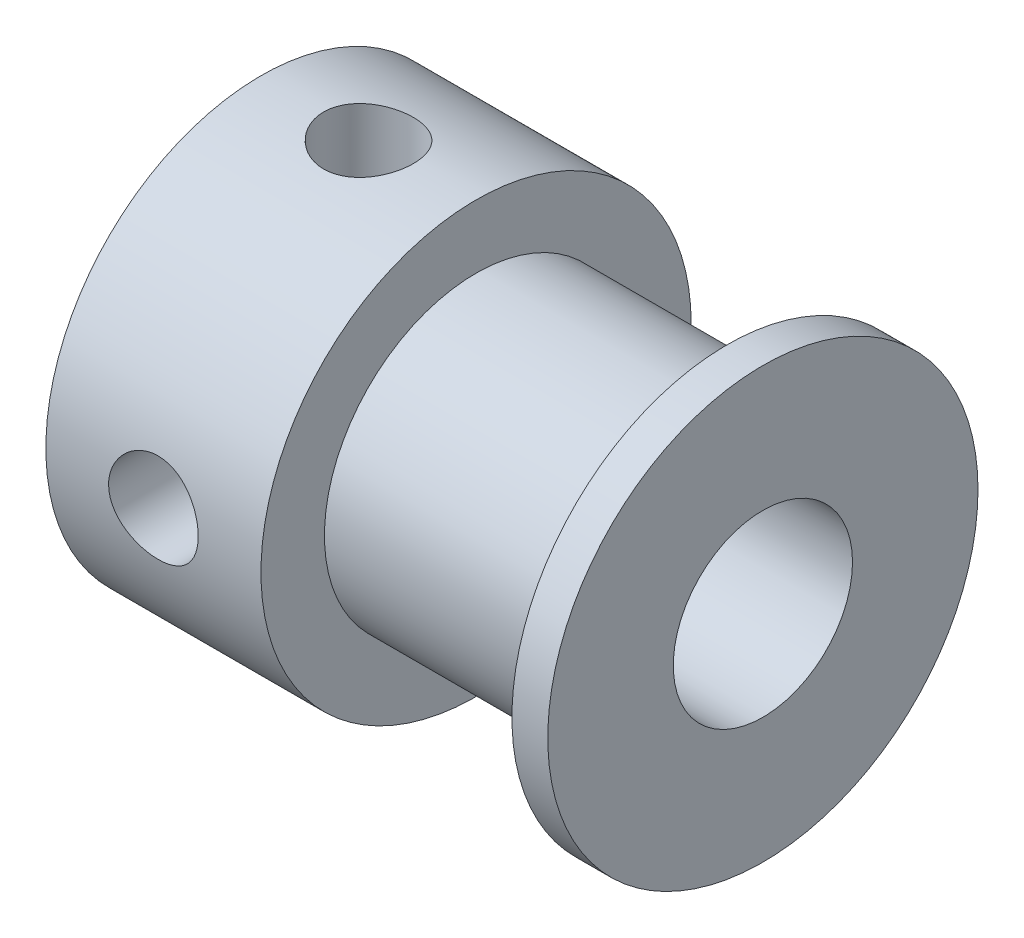
ISO-10303-21;
HEADER;
FILE_DESCRIPTION(('STEP AP214'),'2;1');
FILE_NAME('part.step','',(''),(''),'','','');
FILE_SCHEMA(('AUTOMOTIVE_DESIGN { 1 0 10303 214 1 1 1 1 }'));
ENDSEC;
DATA;
#1=APPLICATION_CONTEXT('core data for automotive mechanical design processes');
#2=APPLICATION_PROTOCOL_DEFINITION('international standard','automotive_design',2000,#1);
#3=PRODUCT_CONTEXT('',#1,'mechanical');
#4=PRODUCT('Part','Part','',(#3));
#5=PRODUCT_RELATED_PRODUCT_CATEGORY('part','',(#4));
#6=PRODUCT_DEFINITION_FORMATION('','',#4);
#7=PRODUCT_DEFINITION_CONTEXT('part definition',#1,'design');
#8=PRODUCT_DEFINITION('design','',#6,#7);
#9=PRODUCT_DEFINITION_SHAPE('','',#8);
#10=(LENGTH_UNIT() NAMED_UNIT(*) SI_UNIT(.MILLI.,.METRE.));
#11=(NAMED_UNIT(*) PLANE_ANGLE_UNIT() SI_UNIT($,.RADIAN.));
#12=(NAMED_UNIT(*) SI_UNIT($,.STERADIAN.) SOLID_ANGLE_UNIT());
#13=UNCERTAINTY_MEASURE_WITH_UNIT(LENGTH_MEASURE(1.E-05),#10,'distance_accuracy_value','');
#14=(GEOMETRIC_REPRESENTATION_CONTEXT(3) GLOBAL_UNCERTAINTY_ASSIGNED_CONTEXT((#13)) GLOBAL_UNIT_ASSIGNED_CONTEXT((#10,
#11,#12)) REPRESENTATION_CONTEXT('',''));
#15=CARTESIAN_POINT('',(0.,0.,0.));
#16=DIRECTION('',(0.,0.,1.));
#17=DIRECTION('',(1.,0.,0.));
#18=AXIS2_PLACEMENT_3D('',#15,#16,#17);
#19=CARTESIAN_POINT('',(0.,0.,0.));
#20=DIRECTION('',(1.,0.,0.));
#21=DIRECTION('',(0.,0.,-1.));
#22=AXIS2_PLACEMENT_3D('',#19,#20,#21);
#23=CYLINDRICAL_SURFACE('',#22,2.5);
#24=CARTESIAN_POINT('',(1.75000000000001,0.,2.5));
#25=CARTESIAN_POINT('',(1.75000412789938,0.0657149536912327,2.49999641755189));
#26=CARTESIAN_POINT('',(1.7552125914021,0.13150824962254,2.49738113774397));
#27=CARTESIAN_POINT('',(1.77581610042615,0.26115029408553,2.48717695046745));
#28=CARTESIAN_POINT('',(1.79123049124707,0.324995108391878,2.4795785978623));
#29=CARTESIAN_POINT('',(1.831492260771,0.448666931100716,2.4602034925414));
#30=CARTESIAN_POINT('',(1.85630298031002,0.508508503673972,2.448442989719));
#31=CARTESIAN_POINT('',(1.91446327670618,0.623090771008203,2.42182220644723));
#32=CARTESIAN_POINT('',(1.94781218031107,0.677831867487559,2.40696217041913));
#33=CARTESIAN_POINT('',(2.02439656185663,0.784384772202394,2.37445322822571));
#34=CARTESIAN_POINT('',(2.06810809904956,0.835819013902635,2.3566899890942));
#35=CARTESIAN_POINT('',(2.1631518490588,0.930974306083716,2.32074962808431));
#36=CARTESIAN_POINT('',(2.21448981471555,0.974689478883452,2.30257220261294));
#37=CARTESIAN_POINT('',(2.32810418690423,1.05656500056284,2.26623688996684));
#38=CARTESIAN_POINT('',(2.39092012293239,1.09403166943954,2.24818983712665));
#39=CARTESIAN_POINT('',(2.52295916998277,1.15771028361336,2.21607473465401));
#40=CARTESIAN_POINT('',(2.59217766090344,1.18393026870791,2.20200384508737));
#41=CARTESIAN_POINT('',(2.73083138177741,1.22266555273573,2.18072333797261));
#42=CARTESIAN_POINT('',(2.80000556508424,1.23590732135054,2.17315339479642));
#43=CARTESIAN_POINT('',(2.93997354722435,1.25053374163605,2.1647736243566));
#44=CARTESIAN_POINT('',(3.01076567608894,1.25193011046634,2.16395711679111));
#45=CARTESIAN_POINT('',(3.14285753039421,1.24335910896536,2.16888662821561));
#46=CARTESIAN_POINT('',(3.20428003902881,1.23473069942102,2.17385954577517));
#47=CARTESIAN_POINT('',(3.3246523867163,1.20867481132116,2.18845285917313));
#48=CARTESIAN_POINT('',(3.38360143163164,1.19124452987206,2.19807473539721));
#49=CARTESIAN_POINT('',(3.49903641570707,1.1477622254825,2.22109345515927));
#50=CARTESIAN_POINT('',(3.55543299848223,1.12151883389499,2.23457300829999));
#51=CARTESIAN_POINT('',(3.66329286573751,1.061302109585,2.26379255351755));
#52=CARTESIAN_POINT('',(3.71475391950011,1.02732530476558,2.27953355975239));
#53=CARTESIAN_POINT('',(3.81815156592903,0.94758256864098,2.31391447379108));
#54=CARTESIAN_POINT('',(3.86932109197019,0.900868072961596,2.33266887795933));
#55=CARTESIAN_POINT('',(3.96341927323862,0.799444473426712,2.36934529125509));
#56=CARTESIAN_POINT('',(4.00634399004235,0.744731570717852,2.38726689948501));
#57=CARTESIAN_POINT('',(4.08460707628715,0.625645632289807,2.42127484103705));
#58=CARTESIAN_POINT('',(4.11950059055717,0.560941989499257,2.43723730202509));
#59=CARTESIAN_POINT('',(4.17762128630375,0.425582769360993,2.46447351401553));
#60=CARTESIAN_POINT('',(4.20085773126895,0.354931970331593,2.47575098679441));
#61=CARTESIAN_POINT('',(4.23309425464584,0.215958114575875,2.49155417176795));
#62=CARTESIAN_POINT('',(4.24311404468347,0.147926913185404,2.4965617287664));
#63=CARTESIAN_POINT('',(4.2518309139181,0.0109744999366913,2.50091266823877));
#64=CARTESIAN_POINT('',(4.25053335704934,-0.057946274837377,2.5002587340164));
#65=CARTESIAN_POINT('',(4.23724163947655,-0.189041214982492,2.49363990316801));
#66=CARTESIAN_POINT('',(4.22608433408745,-0.251324260062442,2.48809057110237));
#67=CARTESIAN_POINT('',(4.19470241013114,-0.373008615377395,2.47277714143524));
#68=CARTESIAN_POINT('',(4.1744767919333,-0.432409607113745,2.46301257917916));
#69=CARTESIAN_POINT('',(4.12500191695853,-0.548610760562079,2.43980314267087));
#70=CARTESIAN_POINT('',(4.09551118735398,-0.605287996257689,2.42626102212424));
#71=CARTESIAN_POINT('',(4.02861558044244,-0.713076702123648,2.39679967896386));
#72=CARTESIAN_POINT('',(3.9912073317582,-0.764185787219099,2.38087944457232));
#73=CARTESIAN_POINT('',(3.9052994683339,-0.864709611613313,2.34635276671831));
#74=CARTESIAN_POINT('',(3.85607141443304,-0.913465097280795,2.32763606060552));
#75=CARTESIAN_POINT('',(3.75009356091336,-1.00232040139154,2.29077989504843));
#76=CARTESIAN_POINT('',(3.69333860147953,-1.04241423211355,2.27264084226908));
#77=CARTESIAN_POINT('',(3.57044543224961,-1.11463489312211,2.23813990282585));
#78=CARTESIAN_POINT('',(3.50398591723925,-1.14628186984829,2.2219066207934));
#79=CARTESIAN_POINT('',(3.36561241538434,-1.19760353251725,2.19467590460158));
#80=CARTESIAN_POINT('',(3.29370559187351,-1.21729364485946,2.18367172800773));
#81=CARTESIAN_POINT('',(3.15386222142319,-1.24232710931209,2.16951876260834));
#82=CARTESIAN_POINT('',(3.0862071832137,-1.24886624550107,2.16571729325614));
#83=CARTESIAN_POINT('',(2.95069116603659,-1.25086144297598,2.16456693307719));
#84=CARTESIAN_POINT('',(2.88283028907571,-1.24632230828049,2.16721524534441));
#85=CARTESIAN_POINT('',(2.75564562308498,-1.22740765699032,2.17797327562531));
#86=CARTESIAN_POINT('',(2.6961244123195,-1.21401039292849,2.18553868102992));
#87=CARTESIAN_POINT('',(2.58023985071912,-1.1789691977808,2.20463770234897));
#88=CARTESIAN_POINT('',(2.52387752238504,-1.15732261394975,2.21617259462095));
#89=CARTESIAN_POINT('',(2.41171893626674,-1.10476968162585,2.2428566295566));
#90=CARTESIAN_POINT('',(2.35621512271288,-1.07333892227057,2.25819652995239));
#91=CARTESIAN_POINT('',(2.25090682977427,-1.00268871454579,2.29044164543238));
#92=CARTESIAN_POINT('',(2.20110533685189,-0.963465214048303,2.30734767243153));
#93=CARTESIAN_POINT('',(2.10232252205298,-0.872754158330795,2.34327903949142));
#94=CARTESIAN_POINT('',(2.0541761220476,-0.820355528762707,2.36231229139336));
#95=CARTESIAN_POINT('',(1.96717127072046,-0.707693507775343,2.3984719031886));
#96=CARTESIAN_POINT('',(1.92831782571714,-0.647425904070975,2.4155972326005));
#97=CARTESIAN_POINT('',(1.86095454654725,-0.519914496024928,2.44622511981379));
#98=CARTESIAN_POINT('',(1.83251978823571,-0.452624379918263,2.45970120703636));
#99=CARTESIAN_POINT('',(1.78773979010132,-0.313427626617735,2.48126676704332));
#100=CARTESIAN_POINT('',(1.77136019146303,-0.241534749528953,2.48937154216165));
#101=CARTESIAN_POINT('',(1.7576282361552,-0.140752433104227,2.49619327387079));
#102=CARTESIAN_POINT('',(1.75477169892048,-0.112702349299371,2.49761706674002));
#103=CARTESIAN_POINT('',(1.750956668104,-0.0564396647589458,2.49952121222331));
#104=CARTESIAN_POINT('',(1.74999822691101,-0.0282270595592261,2.50000153879704));
#105=CARTESIAN_POINT('',(1.75000000000001,0.,2.5));
#106=B_SPLINE_CURVE_WITH_KNOTS('',3,(#24,#25,#26,#27,#28,#29,#30,#31,#32,#33,#34,#35,#36,#37,
#38,#39,#40,#41,#42,#43,#44,#45,#46,#47,#48,#49,#50,#51,#52,#53,#54,#55,#56,#57,#58,#59,#60,#61,
#62,#63,#64,#65,#66,#67,#68,#69,#70,#71,#72,#73,#74,#75,#76,#77,#78,#79,#80,#81,#82,#83,#84,#85,
#86,#87,#88,#89,#90,#91,#92,#93,#94,#95,#96,#97,#98,#99,#100,#101,#102,#103,#104,#105),
.UNSPECIFIED.,.T.,.F.,(4,2,2,2,2,2,2,2,2,2,2,2,2,2,2,2,2,2,2,2,2,2,2,2,2,2,2,2,2,2,2,2,2,2,2,2,
2,2,2,2,4),(0.,0.197030321775364,0.394435187136495,0.59107769436537,0.787704700726955,
0.996227198397605,1.20490779706754,1.4297715803844,1.6544743487285,1.86572515175286,
2.07676696661274,2.26257140511649,2.44843504907097,2.63862800210608,2.82890651575276,
3.04331176667346,3.25781918248356,3.48228777768049,3.70657771140347,3.9122911308918,
4.11790705639343,4.3075863313265,4.49728652038662,4.69241070034871,4.88761813435421,
5.10199513305521,5.31651985769287,5.54143352699589,5.76605639925969,5.96911634372963,
6.17208824825003,6.35572412805225,6.53941910979594,6.73545570969514,6.93159451423693,
7.15156553440619,7.37165479220712,7.59330017078652,7.81431135781158,7.89894100172117,
7.98357298143554),.UNSPECIFIED.);
#107=CARTESIAN_POINT('',(1.75000000000001,0.,2.5));
#108=VERTEX_POINT('',#107);
#109=EDGE_CURVE('E78',#108,#108,#106,.T.);
#110=ORIENTED_EDGE('',*,*,#109,.F.);
#111=EDGE_LOOP('',(#110));
#112=FACE_BOUND('',#111,.T.);
#113=CARTESIAN_POINT('',(3.,2.1650635094611,-1.25));
#114=CARTESIAN_POINT('',(3.06513476024406,2.16506918410574,-1.24999545384316));
#115=CARTESIAN_POINT('',(3.13035176440631,2.16804751484696,-1.24487496341652));
#116=CARTESIAN_POINT('',(3.25878408084644,2.17952958065066,-1.22465401237257));
#117=CARTESIAN_POINT('',(3.32199489380426,2.18804492569449,-1.20953258069272));
#118=CARTESIAN_POINT('',(3.44431458042993,2.20936683256748,-1.17012493587476));
#119=CARTESIAN_POINT('',(3.50344331559198,2.22215054341565,-1.14588744061716));
#120=CARTESIAN_POINT('',(3.6167802524959,2.25053331021072,-1.08908440672046));
#121=CARTESIAN_POINT('',(3.67098818782807,2.26613251845081,-1.05651841754472));
#122=CARTESIAN_POINT('',(3.77788216069688,2.29996086321802,-0.980833175663598));
#123=CARTESIAN_POINT('',(3.83007391959193,2.31830079547442,-0.937065045179713));
#124=CARTESIAN_POINT('',(3.92676048550839,2.35464978482132,-0.841567259518085));
#125=CARTESIAN_POINT('',(3.9712514532294,2.37265867289062,-0.789833657227866));
#126=CARTESIAN_POINT('',(4.05420893893458,2.40776846191186,-0.675611954268182));
#127=CARTESIAN_POINT('',(4.09206720982441,2.42472633022716,-0.612633986265718));
#128=CARTESIAN_POINT('',(4.1564260665572,2.45438445124411,-0.48019628324938));
#129=CARTESIAN_POINT('',(4.18293382017146,2.46708738979677,-0.410740672672694));
#130=CARTESIAN_POINT('',(4.22188082662637,2.48600576555297,-0.272556179907471));
#131=CARTESIAN_POINT('',(4.23518690794442,2.49261850276115,-0.204127238111022));
#132=CARTESIAN_POINT('',(4.2502076483438,2.50009479807584,-0.0657132858723104));
#133=CARTESIAN_POINT('',(4.25192932099464,2.50096183480737,0.00427075730467264));
#134=CARTESIAN_POINT('',(4.24406665753706,2.49703727395563,0.137290655529687));
#135=CARTESIAN_POINT('',(4.23545248059847,2.49273119865201,0.200401498970989));
#136=CARTESIAN_POINT('',(4.20889894511918,2.47967806574684,0.324142214897902));
#137=CARTESIAN_POINT('',(4.19095888877972,2.47093067582992,0.384771901367406));
#138=CARTESIAN_POINT('',(4.14614679238773,2.44964479109568,0.502886739461942));
#139=CARTESIAN_POINT('',(4.11915460853491,2.43705551911499,0.560316779393972));
#140=CARTESIAN_POINT('',(4.05717072974813,2.40922057483359,0.66997100189166));
#141=CARTESIAN_POINT('',(4.02217617087206,2.39397395196855,0.722193311048307));
#142=CARTESIAN_POINT('',(3.94138081058373,2.36055492999037,0.825217076122743));
#143=CARTESIAN_POINT('',(3.89487121459249,2.34224219997719,0.8754175937867));
#144=CARTESIAN_POINT('',(3.79426284383728,2.30567925733515,0.967630462872225));
#145=CARTESIAN_POINT('',(3.74015828465742,2.28742910332036,1.00963651446779));
#146=CARTESIAN_POINT('',(3.62168975946989,2.25180195115606,1.08688166830276));
#147=CARTESIAN_POINT('',(3.55689247118223,2.23455399988385,1.12152164372256));
#148=CARTESIAN_POINT('',(3.42132791080125,2.2046931284822,1.17914889125154));
#149=CARTESIAN_POINT('',(3.35056695872805,2.19207537557584,1.20214832276361));
#150=CARTESIAN_POINT('',(3.21098186089651,2.17430794771293,1.2339752637813));
#151=CARTESIAN_POINT('',(3.14244860119556,2.16864569810621,1.24378140264997));
#152=CARTESIAN_POINT('',(3.00449832310432,2.16397399202012,1.25189618326428));
#153=CARTESIAN_POINT('',(2.93508196360027,2.1649598361164,1.25021294664378));
#154=CARTESIAN_POINT('',(2.80543260177659,2.17292920675731,1.23629505417996));
#155=CARTESIAN_POINT('',(2.74502568611509,2.17924484383318,1.22523477089058));
#156=CARTESIAN_POINT('',(2.6270402671613,2.19617526939176,1.19462035579055));
#157=CARTESIAN_POINT('',(2.56946268656674,2.20679145006292,1.17506347327952));
#158=CARTESIAN_POINT('',(2.45573583637163,2.23170277599571,1.12705948575611));
#159=CARTESIAN_POINT('',(2.39977622893306,2.24614554053829,1.0982425796159));
#160=CARTESIAN_POINT('',(2.29316341057626,2.27695149371562,1.03285883001975));
#161=CARTESIAN_POINT('',(2.2425129456084,2.29331566693935,0.99628800541527));
#162=CARTESIAN_POINT('',(2.14127654059557,2.3285999807042,0.911046458998566));
#163=CARTESIAN_POINT('',(2.09150356160293,2.34758228942861,0.861431590393708));
#164=CARTESIAN_POINT('',(2.00073470250801,2.38417793722366,0.75425561924786));
#165=CARTESIAN_POINT('',(1.95974178721183,2.40179081259637,0.696691843319183));
#166=CARTESIAN_POINT('',(1.88678284256237,2.43426702113696,0.573169203198446));
#167=CARTESIAN_POINT('',(1.85508360223636,2.44904552090037,0.507028871967641));
#168=CARTESIAN_POINT('',(1.80357762017826,2.47354193699126,0.369402955801352));
#169=CARTESIAN_POINT('',(1.78376043579212,2.48326429595466,0.29792212674022));
#170=CARTESIAN_POINT('',(1.75828929478167,2.49584385227353,0.158724602913021));
#171=CARTESIAN_POINT('',(1.75150265515486,2.49924909885239,0.0912643048130715));
#172=CARTESIAN_POINT('',(1.748945918182,2.50052662968914,-0.0439074824390041));
#173=CARTESIAN_POINT('',(1.75317196434555,2.49840085083612,-0.111618875368858));
#174=CARTESIAN_POINT('',(1.77177050849453,2.48917461047403,-0.240672490396433));
#175=CARTESIAN_POINT('',(1.78545606157209,2.48241118334987,-0.302140397264079));
#176=CARTESIAN_POINT('',(1.82165874912871,2.46490117079279,-0.421807440229521));
#177=CARTESIAN_POINT('',(1.84417715011682,2.45415401415995,-0.480006106194385));
#178=CARTESIAN_POINT('',(1.89840881520747,2.4290741343515,-0.594279257806105));
#179=CARTESIAN_POINT('',(1.9304741540098,2.41460771498499,-0.650156428375057));
#180=CARTESIAN_POINT('',(2.00244741357381,2.38360166427283,-0.75596830226753));
#181=CARTESIAN_POINT('',(2.04235893639459,2.36706108197951,-0.805900259268633));
#182=CARTESIAN_POINT('',(2.13349642377838,2.33160762783285,-0.903642505196113));
#183=CARTESIAN_POINT('',(2.18545310934649,2.31262248764622,-0.950747105674089));
#184=CARTESIAN_POINT('',(2.29681340141221,2.27578845203566,-1.03582910924334));
#185=CARTESIAN_POINT('',(2.35622352608461,2.25794057202332,-1.07379843751257));
#186=CARTESIAN_POINT('',(2.48329580822619,2.22499506631145,-1.14053884973207));
#187=CARTESIAN_POINT('',(2.55115941391092,2.21000217820338,-1.16898133245117));
#188=CARTESIAN_POINT('',(2.69166550542472,2.1858269541044,-1.21359838688301));
#189=CARTESIAN_POINT('',(2.76429111114086,2.17662520184628,-1.22981398896918));
#190=CARTESIAN_POINT('',(2.864756694565,2.16911590752238,-1.24295875983052));
#191=CARTESIAN_POINT('',(2.89170986799735,2.1676016125644,-1.24559513120481));
#192=CARTESIAN_POINT('',(2.9457706008528,2.16557419859688,-1.24911675636245));
#193=CARTESIAN_POINT('',(2.97287817048234,2.16506114656387,-1.25000189299984));
#194=CARTESIAN_POINT('',(3.,2.1650635094611,-1.25));
#195=B_SPLINE_CURVE_WITH_KNOTS('',3,(#113,#114,#115,#116,#117,#118,#119,#120,#121,#122,#123,
#124,#125,#126,#127,#128,#129,#130,#131,#132,#133,#134,#135,#136,#137,#138,#139,#140,#141,#142,
#143,#144,#145,#146,#147,#148,#149,#150,#151,#152,#153,#154,#155,#156,#157,#158,#159,#160,#161,
#162,#163,#164,#165,#166,#167,#168,#169,#170,#171,#172,#173,#174,#175,#176,#177,#178,#179,#180,
#181,#182,#183,#184,#185,#186,#187,#188,#189,#190,#191,#192,#193,#194),.UNSPECIFIED.,.T.,.F.,(4,
2,2,2,2,2,2,2,2,2,2,2,2,2,2,2,2,2,2,2,2,2,2,2,2,2,2,2,2,2,2,2,2,2,2,2,2,2,2,2,4),(0.,
0.195290153243394,0.390991116031005,0.585660744898606,0.780340906806436,0.99107789062279,
1.20191963855464,1.42697365298454,1.65188533704864,1.86079356209919,2.0695752960755,
2.26020121855673,2.45084140646819,2.64411918413933,2.8374662418784,3.04908989321113,
3.26087560307398,3.4861105216181,3.71110967764631,3.91827863567764,4.12530116485466,
4.30967729280032,4.49411315545078,4.68709120507609,4.88016857775059,5.09758429475766,
5.31507331222752,5.53830226766207,5.76133474760964,5.96390337986858,6.16640108492464,
6.35555531089365,6.54473666890016,6.74200938399339,6.93937287625898,7.15637802312584,
7.37357428556442,7.59763436298256,7.8209391625345,7.90225168981636,7.98356965618175),.UNSPECIFIED.);
#196=CARTESIAN_POINT('',(3.,2.1650635094611,-1.25));
#197=VERTEX_POINT('',#196);
#198=EDGE_CURVE('E71',#197,#197,#195,.T.);
#199=ORIENTED_EDGE('',*,*,#198,.F.);
#200=EDGE_LOOP('',(#199));
#201=FACE_BOUND('',#200,.T.);
#202=CARTESIAN_POINT('',(14.,0.,0.));
#203=DIRECTION('',(1.,0.,0.));
#204=DIRECTION('',(0.,0.,-1.));
#205=AXIS2_PLACEMENT_3D('',#202,#203,#204);
#206=CIRCLE('',#205,2.5);
#207=CARTESIAN_POINT('',(14.,0.,-2.5));
#208=VERTEX_POINT('',#207);
#209=EDGE_CURVE('E77',#208,#208,#206,.T.);
#210=ORIENTED_EDGE('',*,*,#209,.T.);
#211=EDGE_LOOP('',(#210));
#212=FACE_BOUND('',#211,.T.);
#213=CARTESIAN_POINT('',(0.,0.,0.));
#214=DIRECTION('',(1.,0.,0.));
#215=DIRECTION('',(0.,0.,-1.));
#216=AXIS2_PLACEMENT_3D('',#213,#214,#215);
#217=CIRCLE('',#216,2.5);
#218=CARTESIAN_POINT('',(0.,0.,-2.5));
#219=VERTEX_POINT('',#218);
#220=EDGE_CURVE('E47',#219,#219,#217,.T.);
#221=ORIENTED_EDGE('',*,*,#220,.F.);
#222=EDGE_LOOP('',(#221));
#223=FACE_BOUND('',#222,.T.);
#224=ADVANCED_FACE('F32',(#112,#201,#212,#223),#23,.F.);
#225=CARTESIAN_POINT('',(0.,2.5,0.));
#226=DIRECTION('',(-1.,0.,0.));
#227=DIRECTION('',(0.,0.,1.));
#228=AXIS2_PLACEMENT_3D('',#225,#226,#227);
#229=PLANE('',#228);
#230=ORIENTED_EDGE('',*,*,#220,.T.);
#231=EDGE_LOOP('',(#230));
#232=FACE_BOUND('',#231,.T.);
#233=CARTESIAN_POINT('',(0.,0.,0.));
#234=DIRECTION('',(1.,0.,0.));
#235=DIRECTION('',(0.,0.,-1.));
#236=AXIS2_PLACEMENT_3D('',#233,#234,#235);
#237=CIRCLE('',#236,6.);
#238=CARTESIAN_POINT('',(0.,0.,-6.));
#239=VERTEX_POINT('',#238);
#240=EDGE_CURVE('E51',#239,#239,#237,.T.);
#241=ORIENTED_EDGE('',*,*,#240,.F.);
#242=EDGE_LOOP('',(#241));
#243=FACE_BOUND('',#242,.T.);
#244=ADVANCED_FACE('F102',(#232,#243),#229,.T.);
#245=CARTESIAN_POINT('',(0.,0.,0.));
#246=DIRECTION('',(1.,0.,0.));
#247=DIRECTION('',(0.,0.,-1.));
#248=AXIS2_PLACEMENT_3D('',#245,#246,#247);
#249=CYLINDRICAL_SURFACE('',#248,6.);
#250=CARTESIAN_POINT('',(1.75000000000001,0.,6.));
#251=CARTESIAN_POINT('',(1.75000247746923,-0.0694090417016603,5.99999871526651));
#252=CARTESIAN_POINT('',(1.75580066571876,-0.138848789520875,5.99878328775043));
#253=CARTESIAN_POINT('',(1.77881934953286,-0.275761316266992,5.99405200990679));
#254=CARTESIAN_POINT('',(1.79604852303694,-0.343232560128311,5.99053441189248));
#255=CARTESIAN_POINT('',(1.84137045492183,-0.474209132291339,5.98159109196202));
#256=CARTESIAN_POINT('',(1.86945239599889,-0.537718336709182,5.97616727052645));
#257=CARTESIAN_POINT('',(1.93564960885619,-0.659120328605954,5.96399927809859));
#258=CARTESIAN_POINT('',(1.97376443115584,-0.717013367534323,5.95725516625975));
#259=CARTESIAN_POINT('',(2.05953634019065,-0.826390324308832,5.9430770002465));
#260=CARTESIAN_POINT('',(2.10731200123509,-0.87778024416268,5.93563505848531));
#261=CARTESIAN_POINT('',(2.21079465919511,-0.971877776769387,5.92095657692448));
#262=CARTESIAN_POINT('',(2.26650231187227,-1.01458467096098,5.91372005416683));
#263=CARTESIAN_POINT('',(2.38495196876616,-1.09051031677216,5.90019442595308));
#264=CARTESIAN_POINT('',(2.44775838450275,-1.1236305468065,5.89391545174828));
#265=CARTESIAN_POINT('',(2.57819745177276,-1.17881119348063,5.8831284065002));
#266=CARTESIAN_POINT('',(2.64582958244254,-1.20087280167641,5.87862014467568));
#267=CARTESIAN_POINT('',(2.78298523741564,-1.23300240133736,5.87196500986123));
#268=CARTESIAN_POINT('',(2.85246835933477,-1.24323597696798,5.86978556855865));
#269=CARTESIAN_POINT('',(2.99219684286263,-1.25193357655614,5.86793690716491));
#270=CARTESIAN_POINT('',(3.0624421188653,-1.25039890894686,5.86826740800981));
#271=CARTESIAN_POINT('',(3.20048102797518,-1.23573719037196,5.87137174319175));
#272=CARTESIAN_POINT('',(3.26829597966121,-1.2228010523272,5.87410533679901));
#273=CARTESIAN_POINT('',(3.40077150964492,-1.18600543529945,5.88164437615942));
#274=CARTESIAN_POINT('',(3.46543192560633,-1.16214539481381,5.88644992841317));
#275=CARTESIAN_POINT('',(3.59030722841598,-1.10400003213928,5.89763191464102));
#276=CARTESIAN_POINT('',(3.65048629652707,-1.06964002534236,5.90401953785586));
#277=CARTESIAN_POINT('',(3.76429574426816,-0.991522699274812,5.91763890010721));
#278=CARTESIAN_POINT('',(3.81792530883597,-0.947764212262582,5.92487074398537));
#279=CARTESIAN_POINT('',(3.91821396108037,-0.851074921546778,5.93953730929909));
#280=CARTESIAN_POINT('',(3.96471616889701,-0.797981433412078,5.94697323199473));
#281=CARTESIAN_POINT('',(4.04818044222897,-0.684667288611794,5.96108088143001));
#282=CARTESIAN_POINT('',(4.08514236459839,-0.624446525025762,5.96775259670236));
#283=CARTESIAN_POINT('',(4.14851008153595,-0.498405541235476,5.97959870942815));
#284=CARTESIAN_POINT('',(4.17489680456711,-0.432575461926497,5.98477039710258));
#285=CARTESIAN_POINT('',(4.21619170483549,-0.297284620972153,5.99301338211281));
#286=CARTESIAN_POINT('',(4.23110139323139,-0.227824338595088,5.99608495596053));
#287=CARTESIAN_POINT('',(4.24879425206788,-0.0885918657008341,5.99974275215455));
#288=CARTESIAN_POINT('',(4.25179194149424,-0.018848055526178,6.00037293537579));
#289=CARTESIAN_POINT('',(4.24615505003089,0.120143798757714,5.99919952252774));
#290=CARTESIAN_POINT('',(4.2375211813984,0.189391872962257,5.99739607548153));
#291=CARTESIAN_POINT('',(4.20904434653046,0.324726367119812,5.99158564979184));
#292=CARTESIAN_POINT('',(4.18931251461653,0.390837192894204,5.98760052868077));
#293=CARTESIAN_POINT('',(4.13932213957859,0.518811446661329,5.97787227242395));
#294=CARTESIAN_POINT('',(4.10906275913401,0.580674536336772,5.97212899744579));
#295=CARTESIAN_POINT('',(4.03841962176243,0.699294306943491,5.95941241490714));
#296=CARTESIAN_POINT('',(3.99790807043093,0.755973219469831,5.9524239381233));
#297=CARTESIAN_POINT('',(3.90808043692372,0.861805445886516,5.93802568299709));
#298=CARTESIAN_POINT('',(3.85876332448105,0.910957877913282,5.93061585542511));
#299=CARTESIAN_POINT('',(3.7517444230003,1.0011786486518,5.91606024531377));
#300=CARTESIAN_POINT('',(3.69391696804471,1.04209914600204,5.90892089307501));
#301=CARTESIAN_POINT('',(3.57208371578621,1.11364719079243,5.89585601015805));
#302=CARTESIAN_POINT('',(3.50807817586089,1.14427516677863,5.88993042894651));
#303=CARTESIAN_POINT('',(3.37603880370177,1.19417246443921,5.88001700708041));
#304=CARTESIAN_POINT('',(3.30802896283416,1.21350309828031,5.87601872784687));
#305=CARTESIAN_POINT('',(3.16963344950774,1.24044038523407,5.87039184709697));
#306=CARTESIAN_POINT('',(3.09924811838056,1.2480487154444,5.86876290660367));
#307=CARTESIAN_POINT('',(2.95958659900035,1.25125926487611,5.86807907308506));
#308=CARTESIAN_POINT('',(2.89031592977795,1.24709542622725,5.86897402321502));
#309=CARTESIAN_POINT('',(2.75348599107978,1.22739905314031,5.87312447254928));
#310=CARTESIAN_POINT('',(2.6859267051839,1.21186662782265,5.87637994909626));
#311=CARTESIAN_POINT('',(2.55460222810934,1.16998217768584,5.88486132447716));
#312=CARTESIAN_POINT('',(2.49082675351308,1.14366117568421,5.8900815700793));
#313=CARTESIAN_POINT('',(2.36856122397334,1.08097457299757,5.90190705738738));
#314=CARTESIAN_POINT('',(2.31007166036688,1.04460803983029,5.9085124276546));
#315=CARTESIAN_POINT('',(2.19887837292056,0.962073695342405,5.92251579551146));
#316=CARTESIAN_POINT('',(2.14630087543502,0.915737890418221,5.92992613868404));
#317=CARTESIAN_POINT('',(2.04959050677365,0.81492443811533,5.94461839583213));
#318=CARTESIAN_POINT('',(2.00545958244852,0.760444918832964,5.9519002798488));
#319=CARTESIAN_POINT('',(1.92641142681595,0.644134427507699,5.96561444547637));
#320=CARTESIAN_POINT('',(1.89160632011372,0.582225921521345,5.97203596073244));
#321=CARTESIAN_POINT('',(1.83294977156998,0.453319843998451,5.98319908494092));
#322=CARTESIAN_POINT('',(1.80908875281813,0.386326781907242,5.98794216182101));
#323=CARTESIAN_POINT('',(1.77745972171158,0.266015292900104,5.99432499781443));
#324=CARTESIAN_POINT('',(1.76718123679115,0.213367593727928,5.99644035661395));
#325=CARTESIAN_POINT('',(1.75345054572268,0.107152674176536,5.99927832789758));
#326=CARTESIAN_POINT('',(1.74999808733281,0.0535854878488716,6.00000099184586));
#327=CARTESIAN_POINT('',(1.75000000000001,0.,6.));
#328=B_SPLINE_CURVE_WITH_KNOTS('',3,(#250,#251,#252,#253,#254,#255,#256,#257,#258,#259,#260,
#261,#262,#263,#264,#265,#266,#267,#268,#269,#270,#271,#272,#273,#274,#275,#276,#277,#278,#279,
#280,#281,#282,#283,#284,#285,#286,#287,#288,#289,#290,#291,#292,#293,#294,#295,#296,#297,#298,
#299,#300,#301,#302,#303,#304,#305,#306,#307,#308,#309,#310,#311,#312,#313,#314,#315,#316,#317,
#318,#319,#320,#321,#322,#323,#324,#325,#326,#327),.UNSPECIFIED.,.T.,.F.,(4,2,2,2,2,2,2,2,2,2,2,
2,2,2,2,2,2,2,2,2,2,2,2,2,2,2,2,2,2,2,2,2,2,2,2,2,2,2,4),(0.,0.208031045103182,
0.416220199906223,0.624202378825439,0.832175241572985,1.04287526388122,1.25359271551785,
1.46640449178548,1.67919333285489,1.88896575169853,2.09871484767163,2.30501712129058,
2.51133000030278,2.71914592416748,2.92698768368033,3.13889526355464,3.35080602278216,
3.56309724499661,3.77536051045769,3.98378339407673,4.19219351552275,4.39855286632619,
4.60492863390931,4.81401583995734,5.02312752564571,5.23571263829333,5.44828889851306,
5.65970050095022,5.87108185414182,6.07829223291035,6.28550062281358,6.49211731393252,
6.69875319081476,6.90919024830305,7.11967575117366,7.33258864398252,7.54531486464969,
7.70592588477276,7.86653096973387),.UNSPECIFIED.);
#329=CARTESIAN_POINT('',(1.75000000000001,0.,6.));
#330=VERTEX_POINT('',#329);
#331=EDGE_CURVE('E10',#330,#330,#328,.T.);
#332=ORIENTED_EDGE('',*,*,#331,.F.);
#333=EDGE_LOOP('',(#332));
#334=FACE_BOUND('',#333,.T.);
#335=CARTESIAN_POINT('',(4.25,6.,0.));
#336=CARTESIAN_POINT('',(4.24999752253078,5.99999871526651,-0.0694090417016606));
#337=CARTESIAN_POINT('',(4.24419933428125,5.99878328775043,-0.138848789520875));
#338=CARTESIAN_POINT('',(4.22118065046715,5.99405200990679,-0.275761316266993));
#339=CARTESIAN_POINT('',(4.20395147696307,5.99053441189248,-0.343232560128312));
#340=CARTESIAN_POINT('',(4.15862954507818,5.98159109196202,-0.474209132291342));
#341=CARTESIAN_POINT('',(4.13054760400111,5.97616727052645,-0.537718336709185));
#342=CARTESIAN_POINT('',(4.06435039114382,5.96399927809859,-0.659120328605958));
#343=CARTESIAN_POINT('',(4.02623556884417,5.95725516625975,-0.717013367534327));
#344=CARTESIAN_POINT('',(3.94046365980936,5.9430770002465,-0.826390324308836));
#345=CARTESIAN_POINT('',(3.89268799876492,5.93563505848531,-0.877780244162685));
#346=CARTESIAN_POINT('',(3.78920534080489,5.92095657692448,-0.971877776769392));
#347=CARTESIAN_POINT('',(3.73349768812774,5.91372005416683,-1.01458467096099));
#348=CARTESIAN_POINT('',(3.61504803123384,5.90019442595308,-1.09051031677217));
#349=CARTESIAN_POINT('',(3.55224161549726,5.89391545174828,-1.12363054680651));
#350=CARTESIAN_POINT('',(3.42180254822724,5.8831284065002,-1.17881119348064));
#351=CARTESIAN_POINT('',(3.35417041755746,5.87862014467568,-1.20087280167641));
#352=CARTESIAN_POINT('',(3.21701476258436,5.87196500986122,-1.23300240133737));
#353=CARTESIAN_POINT('',(3.14753164066523,5.86978556855865,-1.24323597696799));
#354=CARTESIAN_POINT('',(3.00780315713737,5.86793690716491,-1.25193357655615));
#355=CARTESIAN_POINT('',(2.9375578811347,5.86826740800981,-1.25039890894687));
#356=CARTESIAN_POINT('',(2.79951897202482,5.87137174319175,-1.23573719037197));
#357=CARTESIAN_POINT('',(2.73170402033879,5.87410533679901,-1.2228010523272));
#358=CARTESIAN_POINT('',(2.59922849035507,5.88164437615942,-1.18600543529945));
#359=CARTESIAN_POINT('',(2.53456807439367,5.88644992841317,-1.16214539481382));
#360=CARTESIAN_POINT('',(2.40969277158402,5.89763191464102,-1.10400003213928));
#361=CARTESIAN_POINT('',(2.34951370347293,5.90401953785586,-1.06964002534237));
#362=CARTESIAN_POINT('',(2.23570425573184,5.91763890010721,-0.991522699274817));
#363=CARTESIAN_POINT('',(2.18207469116402,5.92487074398537,-0.947764212262587));
#364=CARTESIAN_POINT('',(2.08178603891963,5.93953730929909,-0.851074921546782));
#365=CARTESIAN_POINT('',(2.03528383110299,5.94697323199473,-0.797981433412082));
#366=CARTESIAN_POINT('',(1.95181955777103,5.96108088143001,-0.684667288611798));
#367=CARTESIAN_POINT('',(1.9148576354016,5.96775259670236,-0.624446525025765));
#368=CARTESIAN_POINT('',(1.85148991846405,5.97959870942815,-0.498405541235478));
#369=CARTESIAN_POINT('',(1.82510319543288,5.98477039710258,-0.432575461926499));
#370=CARTESIAN_POINT('',(1.78380829516451,5.99301338211281,-0.297284620972155));
#371=CARTESIAN_POINT('',(1.7688986067686,5.99608495596053,-0.227824338595089));
#372=CARTESIAN_POINT('',(1.75120574793212,5.99974275215455,-0.0885918657008347));
#373=CARTESIAN_POINT('',(1.74820805850575,6.00037293537579,-0.0188480555261782));
#374=CARTESIAN_POINT('',(1.7538449499691,5.99919952252774,0.120143798757715));
#375=CARTESIAN_POINT('',(1.7624788186016,5.99739607548153,0.189391872962258));
#376=CARTESIAN_POINT('',(1.79095565346953,5.99158564979184,0.324726367119814));
#377=CARTESIAN_POINT('',(1.81068748538347,5.98760052868077,0.390837192894206));
#378=CARTESIAN_POINT('',(1.86067786042141,5.97787227242395,0.518811446661331));
#379=CARTESIAN_POINT('',(1.89093724086598,5.97212899744579,0.580674536336775));
#380=CARTESIAN_POINT('',(1.96158037823756,5.95941241490714,0.699294306943494));
#381=CARTESIAN_POINT('',(2.00209192956906,5.9524239381233,0.755973219469834));
#382=CARTESIAN_POINT('',(2.09191956307627,5.93802568299709,0.86180544588652));
#383=CARTESIAN_POINT('',(2.14123667551894,5.93061585542511,0.910957877913286));
#384=CARTESIAN_POINT('',(2.2482555769997,5.91606024531377,1.0011786486518));
#385=CARTESIAN_POINT('',(2.30608303195528,5.90892089307501,1.04209914600204));
#386=CARTESIAN_POINT('',(2.42791628421379,5.89585601015805,1.11364719079243));
#387=CARTESIAN_POINT('',(2.49192182413911,5.88993042894651,1.14427516677864));
#388=CARTESIAN_POINT('',(2.62396119629823,5.88001700708041,1.19417246443922));
#389=CARTESIAN_POINT('',(2.69197103716584,5.87601872784687,1.21350309828032));
#390=CARTESIAN_POINT('',(2.83036655049226,5.87039184709697,1.24044038523407));
#391=CARTESIAN_POINT('',(2.90075188161944,5.86876290660367,1.24804871544441));
#392=CARTESIAN_POINT('',(3.04041340099965,5.86807907308506,1.25125926487611));
#393=CARTESIAN_POINT('',(3.10968407022205,5.86897402321502,1.24709542622725));
#394=CARTESIAN_POINT('',(3.24651400892022,5.87312447254927,1.22739905314032));
#395=CARTESIAN_POINT('',(3.31407329481611,5.87637994909626,1.21186662782266));
#396=CARTESIAN_POINT('',(3.44539777189066,5.88486132447716,1.16998217768585));
#397=CARTESIAN_POINT('',(3.50917324648693,5.8900815700793,1.14366117568421));
#398=CARTESIAN_POINT('',(3.63143877602667,5.90190705738738,1.08097457299757));
#399=CARTESIAN_POINT('',(3.68992833963313,5.9085124276546,1.0446080398303));
#400=CARTESIAN_POINT('',(3.80112162707945,5.92251579551146,0.96207369534241));
#401=CARTESIAN_POINT('',(3.85369912456498,5.92992613868404,0.915737890418225));
#402=CARTESIAN_POINT('',(3.95040949322636,5.94461839583213,0.814924438115334));
#403=CARTESIAN_POINT('',(3.99454041755149,5.9519002798488,0.760444918832967));
#404=CARTESIAN_POINT('',(4.07358857318406,5.96561444547637,0.644134427507703));
#405=CARTESIAN_POINT('',(4.10839367988629,5.97203596073244,0.582225921521348));
#406=CARTESIAN_POINT('',(4.16705022843002,5.98319908494092,0.453319843998453));
#407=CARTESIAN_POINT('',(4.19091124718187,5.98794216182101,0.386326781907243));
#408=CARTESIAN_POINT('',(4.22254027828842,5.99432499781443,0.266015292900104));
#409=CARTESIAN_POINT('',(4.23281876320886,5.99644035661395,0.213367593727928));
#410=CARTESIAN_POINT('',(4.24654945427733,5.99927832789758,0.107152674176537));
#411=CARTESIAN_POINT('',(4.25000191266719,6.00000099184586,0.0535854878488716));
#412=CARTESIAN_POINT('',(4.25,6.,0.));
#413=B_SPLINE_CURVE_WITH_KNOTS('',3,(#335,#336,#337,#338,#339,#340,#341,#342,#343,#344,#345,
#346,#347,#348,#349,#350,#351,#352,#353,#354,#355,#356,#357,#358,#359,#360,#361,#362,#363,#364,
#365,#366,#367,#368,#369,#370,#371,#372,#373,#374,#375,#376,#377,#378,#379,#380,#381,#382,#383,
#384,#385,#386,#387,#388,#389,#390,#391,#392,#393,#394,#395,#396,#397,#398,#399,#400,#401,#402,
#403,#404,#405,#406,#407,#408,#409,#410,#411,#412),.UNSPECIFIED.,.T.,.F.,(4,2,2,2,2,2,2,2,2,2,2,
2,2,2,2,2,2,2,2,2,2,2,2,2,2,2,2,2,2,2,2,2,2,2,2,2,2,2,4),(0.,0.208031045103183,
0.416220199906225,0.624202378825443,0.832175241572989,1.04287526388123,1.25359271551786,
1.46640449178548,1.6791933328549,1.88896575169854,2.09871484767164,2.30501712129059,
2.5113300003028,2.71914592416749,2.92698768368034,3.13889526355466,3.35080602278218,
3.56309724499662,3.77536051045771,3.98378339407675,4.19219351552277,4.39855286632621,
4.60492863390933,4.81401583995737,5.02312752564574,5.23571263829336,5.44828889851309,
5.65970050095025,5.87108185414185,6.07829223291038,6.28550062281361,6.49211731393255,
6.6987531908148,6.90919024830309,7.11967575117369,7.33258864398256,7.54531486464973,
7.7059258847728,7.86653096973391),.UNSPECIFIED.);
#414=CARTESIAN_POINT('',(4.25,6.,0.));
#415=VERTEX_POINT('',#414);
#416=EDGE_CURVE('E43',#415,#415,#413,.T.);
#417=ORIENTED_EDGE('',*,*,#416,.F.);
#418=EDGE_LOOP('',(#417));
#419=FACE_BOUND('',#418,.T.);
#420=ORIENTED_EDGE('',*,*,#240,.T.);
#421=EDGE_LOOP('',(#420));
#422=FACE_BOUND('',#421,.T.);
#423=CARTESIAN_POINT('',(6.,0.,0.));
#424=DIRECTION('',(1.,0.,0.));
#425=DIRECTION('',(0.,0.,-1.));
#426=AXIS2_PLACEMENT_3D('',#423,#424,#425);
#427=CIRCLE('',#426,6.);
#428=CARTESIAN_POINT('',(6.,0.,-6.));
#429=VERTEX_POINT('',#428);
#430=EDGE_CURVE('E95',#429,#429,#427,.T.);
#431=ORIENTED_EDGE('',*,*,#430,.F.);
#432=EDGE_LOOP('',(#431));
#433=FACE_BOUND('',#432,.T.);
#434=ADVANCED_FACE('F57',(#334,#419,#422,#433),#249,.T.);
#435=CARTESIAN_POINT('',(6.,6.,0.));
#436=DIRECTION('',(1.,0.,0.));
#437=DIRECTION('',(0.,0.,-1.));
#438=AXIS2_PLACEMENT_3D('',#435,#436,#437);
#439=PLANE('',#438);
#440=ORIENTED_EDGE('',*,*,#430,.T.);
#441=EDGE_LOOP('',(#440));
#442=FACE_BOUND('',#441,.T.);
#443=CARTESIAN_POINT('',(6.,0.,0.));
#444=DIRECTION('',(1.,0.,0.));
#445=DIRECTION('',(0.,0.,-1.));
#446=AXIS2_PLACEMENT_3D('',#443,#444,#445);
#447=CIRCLE('',#446,4.2291);
#448=CARTESIAN_POINT('',(6.,0.,-4.2291));
#449=VERTEX_POINT('',#448);
#450=EDGE_CURVE('E92',#449,#449,#447,.T.);
#451=ORIENTED_EDGE('',*,*,#450,.F.);
#452=EDGE_LOOP('',(#451));
#453=FACE_BOUND('',#452,.T.);
#454=ADVANCED_FACE('F109',(#442,#453),#439,.T.);
#455=CARTESIAN_POINT('',(0.,0.,0.));
#456=DIRECTION('',(1.,0.,0.));
#457=DIRECTION('',(0.,0.,-1.));
#458=AXIS2_PLACEMENT_3D('',#455,#456,#457);
#459=CYLINDRICAL_SURFACE('',#458,4.2291);
#460=ORIENTED_EDGE('',*,*,#450,.T.);
#461=EDGE_LOOP('',(#460));
#462=FACE_BOUND('',#461,.T.);
#463=CARTESIAN_POINT('',(13.,0.,0.));
#464=DIRECTION('',(1.,0.,0.));
#465=DIRECTION('',(0.,0.,-1.));
#466=AXIS2_PLACEMENT_3D('',#463,#464,#465);
#467=CIRCLE('',#466,4.2291);
#468=CARTESIAN_POINT('',(13.,0.,-4.2291));
#469=VERTEX_POINT('',#468);
#470=EDGE_CURVE('E89',#469,#469,#467,.T.);
#471=ORIENTED_EDGE('',*,*,#470,.F.);
#472=EDGE_LOOP('',(#471));
#473=FACE_BOUND('',#472,.T.);
#474=ADVANCED_FACE('F136',(#462,#473),#459,.T.);
#475=CARTESIAN_POINT('',(13.,4.2291,0.));
#476=DIRECTION('',(-1.,0.,0.));
#477=DIRECTION('',(0.,0.,1.));
#478=AXIS2_PLACEMENT_3D('',#475,#476,#477);
#479=PLANE('',#478);
#480=ORIENTED_EDGE('',*,*,#470,.T.);
#481=EDGE_LOOP('',(#480));
#482=FACE_BOUND('',#481,.T.);
#483=CARTESIAN_POINT('',(13.,0.,0.));
#484=DIRECTION('',(1.,0.,0.));
#485=DIRECTION('',(0.,0.,-1.));
#486=AXIS2_PLACEMENT_3D('',#483,#484,#485);
#487=CIRCLE('',#486,6.);
#488=CARTESIAN_POINT('',(13.,0.,-6.));
#489=VERTEX_POINT('',#488);
#490=EDGE_CURVE('E86',#489,#489,#487,.T.);
#491=ORIENTED_EDGE('',*,*,#490,.F.);
#492=EDGE_LOOP('',(#491));
#493=FACE_BOUND('',#492,.T.);
#494=ADVANCED_FACE('F129',(#482,#493),#479,.T.);
#495=CARTESIAN_POINT('',(0.,0.,0.));
#496=DIRECTION('',(1.,0.,0.));
#497=DIRECTION('',(0.,0.,-1.));
#498=AXIS2_PLACEMENT_3D('',#495,#496,#497);
#499=CYLINDRICAL_SURFACE('',#498,6.);
#500=ORIENTED_EDGE('',*,*,#490,.T.);
#501=EDGE_LOOP('',(#500));
#502=FACE_BOUND('',#501,.T.);
#503=CARTESIAN_POINT('',(14.,0.,0.));
#504=DIRECTION('',(1.,0.,0.));
#505=DIRECTION('',(0.,0.,-1.));
#506=AXIS2_PLACEMENT_3D('',#503,#504,#505);
#507=CIRCLE('',#506,6.);
#508=CARTESIAN_POINT('',(14.,0.,-6.));
#509=VERTEX_POINT('',#508);
#510=EDGE_CURVE('E83',#509,#509,#507,.T.);
#511=ORIENTED_EDGE('',*,*,#510,.F.);
#512=EDGE_LOOP('',(#511));
#513=FACE_BOUND('',#512,.T.);
#514=ADVANCED_FACE('F124',(#502,#513),#499,.T.);
#515=CARTESIAN_POINT('',(14.,6.,0.));
#516=DIRECTION('',(1.,0.,0.));
#517=DIRECTION('',(0.,0.,-1.));
#518=AXIS2_PLACEMENT_3D('',#515,#516,#517);
#519=PLANE('',#518);
#520=ORIENTED_EDGE('',*,*,#510,.T.);
#521=EDGE_LOOP('',(#520));
#522=FACE_BOUND('',#521,.T.);
#523=ORIENTED_EDGE('',*,*,#209,.F.);
#524=EDGE_LOOP('',(#523));
#525=FACE_BOUND('',#524,.T.);
#526=ADVANCED_FACE('F65',(#522,#525),#519,.T.);
#527=CARTESIAN_POINT('',(3.,0.,0.));
#528=DIRECTION('',(0.,-1.,0.));
#529=DIRECTION('',(0.,0.,-1.));
#530=AXIS2_PLACEMENT_3D('',#527,#528,#529);
#531=CYLINDRICAL_SURFACE('',#530,1.25);
#532=ORIENTED_EDGE('',*,*,#198,.T.);
#533=EDGE_LOOP('',(#532));
#534=FACE_BOUND('',#533,.T.);
#535=ORIENTED_EDGE('',*,*,#416,.T.);
#536=EDGE_LOOP('',(#535));
#537=FACE_BOUND('',#536,.T.);
#538=ADVANCED_FACE('F60',(#534,#537),#531,.F.);
#539=CARTESIAN_POINT('',(3.,0.,0.));
#540=DIRECTION('',(0.,0.,-1.));
#541=DIRECTION('',(-1.,0.,0.));
#542=AXIS2_PLACEMENT_3D('',#539,#540,#541);
#543=CYLINDRICAL_SURFACE('',#542,1.24999999999999);
#544=ORIENTED_EDGE('',*,*,#109,.T.);
#545=EDGE_LOOP('',(#544));
#546=FACE_BOUND('',#545,.T.);
#547=ORIENTED_EDGE('',*,*,#331,.T.);
#548=EDGE_LOOP('',(#547));
#549=FACE_BOUND('',#548,.T.);
#550=ADVANCED_FACE('F64',(#546,#549),#543,.F.);
#551=CLOSED_SHELL('',(#224,#244,#434,#454,#474,#494,#514,#526,#538,#550));
#552=MANIFOLD_SOLID_BREP('B2',#551);
#553=ADVANCED_BREP_SHAPE_REPRESENTATION('',(#18,#552),#14);
#554=SHAPE_DEFINITION_REPRESENTATION(#9,#553);
ENDSEC;
END-ISO-10303-21;
